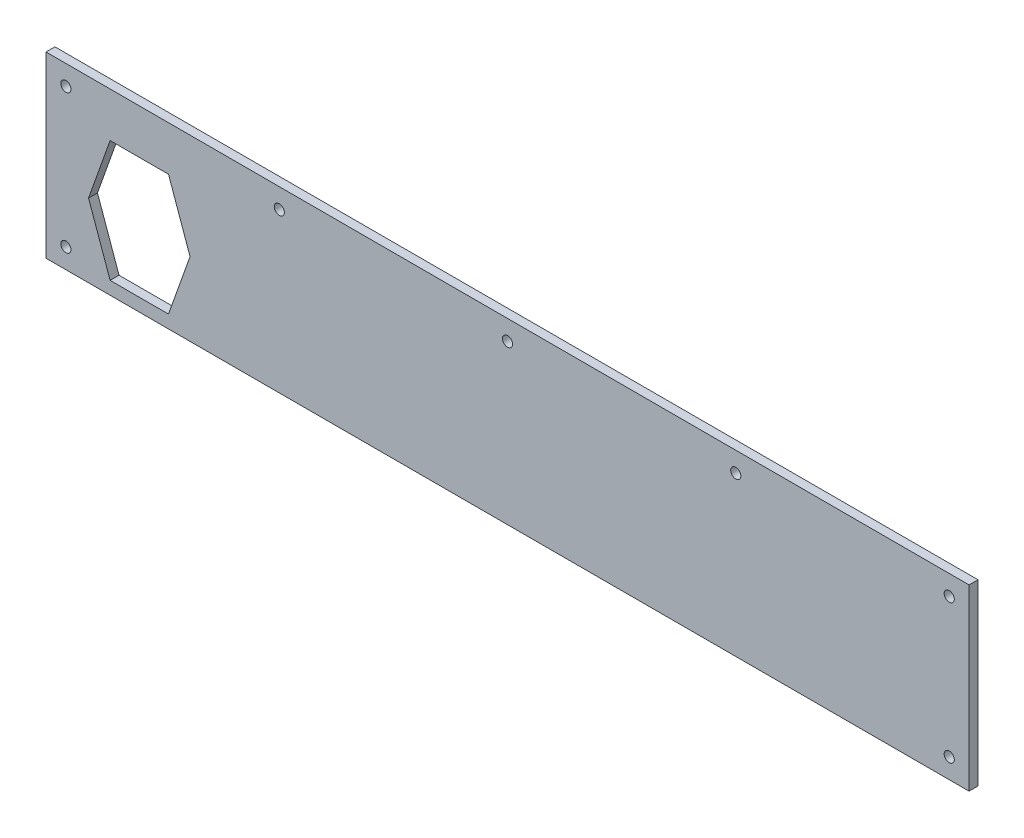
ISO-10303-21;
HEADER;
FILE_DESCRIPTION(('STEP AP214'),'2;1');
FILE_NAME('part.step','',(''),(''),'','','');
FILE_SCHEMA(('AUTOMOTIVE_DESIGN { 1 0 10303 214 1 1 1 1 }'));
ENDSEC;
DATA;
#1=APPLICATION_CONTEXT('core data for automotive mechanical design processes');
#2=APPLICATION_PROTOCOL_DEFINITION('international standard','automotive_design',2000,#1);
#3=PRODUCT_CONTEXT('',#1,'mechanical');
#4=PRODUCT('Part','Part','',(#3));
#5=PRODUCT_RELATED_PRODUCT_CATEGORY('part','',(#4));
#6=PRODUCT_DEFINITION_FORMATION('','',#4);
#7=PRODUCT_DEFINITION_CONTEXT('part definition',#1,'design');
#8=PRODUCT_DEFINITION('design','',#6,#7);
#9=PRODUCT_DEFINITION_SHAPE('','',#8);
#10=(LENGTH_UNIT() NAMED_UNIT(*) SI_UNIT(.MILLI.,.METRE.));
#11=(NAMED_UNIT(*) PLANE_ANGLE_UNIT() SI_UNIT($,.RADIAN.));
#12=(NAMED_UNIT(*) SI_UNIT($,.STERADIAN.) SOLID_ANGLE_UNIT());
#13=UNCERTAINTY_MEASURE_WITH_UNIT(LENGTH_MEASURE(1.E-05),#10,'distance_accuracy_value','');
#14=(GEOMETRIC_REPRESENTATION_CONTEXT(3) GLOBAL_UNCERTAINTY_ASSIGNED_CONTEXT((#13)) GLOBAL_UNIT_ASSIGNED_CONTEXT((#10,
#11,#12)) REPRESENTATION_CONTEXT('',''));
#15=CARTESIAN_POINT('',(0.,0.,0.));
#16=DIRECTION('',(0.,0.,1.));
#17=DIRECTION('',(1.,0.,0.));
#18=AXIS2_PLACEMENT_3D('',#15,#16,#17);
#19=CARTESIAN_POINT('',(0.,0.,2.2479));
#20=DIRECTION('',(0.,0.,-1.));
#21=DIRECTION('',(-1.,0.,0.));
#22=AXIS2_PLACEMENT_3D('',#19,#20,#21);
#23=PLANE('',#22);
#24=DIRECTION('',(-0.335324665526644,0.942102631717715,0.));
#25=VECTOR('',#24,1.);
#26=CARTESIAN_POINT('',(-159.938544521231,-7.99999999999997,2.2479));
#27=LINE('',#26,#25);
#28=CARTESIAN_POINT('',(-159.938544521231,-7.99999999999997,2.2479));
#29=VERTEX_POINT('',#28);
#30=CARTESIAN_POINT('',(-170.79447672462,22.5,2.2479));
#31=VERTEX_POINT('',#30);
#32=EDGE_CURVE('E130',#29,#31,#27,.T.);
#33=ORIENTED_EDGE('',*,*,#32,.F.);
#34=DIRECTION('',(0.335324665526644,0.942102631717715,0.));
#35=VECTOR('',#34,1.);
#36=CARTESIAN_POINT('',(-170.79447672462,-38.5,2.2479));
#37=LINE('',#36,#35);
#38=CARTESIAN_POINT('',(-170.79447672462,-38.5,2.2479));
#39=VERTEX_POINT('',#38);
#40=EDGE_CURVE('E48',#39,#29,#37,.T.);
#41=ORIENTED_EDGE('',*,*,#40,.F.);
#42=DIRECTION('',(1.,0.,0.));
#43=VECTOR('',#42,1.);
#44=CARTESIAN_POINT('',(-200.20552327538,-38.5,2.2479));
#45=LINE('',#44,#43);
#46=CARTESIAN_POINT('',(-200.20552327538,-38.5,2.2479));
#47=VERTEX_POINT('',#46);
#48=EDGE_CURVE('E122',#47,#39,#45,.T.);
#49=ORIENTED_EDGE('',*,*,#48,.F.);
#50=DIRECTION('',(0.335324665526644,-0.942102631717715,0.));
#51=VECTOR('',#50,1.);
#52=CARTESIAN_POINT('',(-211.06145547877,-7.99999999999997,2.2479));
#53=LINE('',#52,#51);
#54=CARTESIAN_POINT('',(-211.06145547877,-7.99999999999997,2.2479));
#55=VERTEX_POINT('',#54);
#56=EDGE_CURVE('E143',#55,#47,#53,.T.);
#57=ORIENTED_EDGE('',*,*,#56,.F.);
#58=DIRECTION('',(-0.335324665526644,-0.942102631717715,0.));
#59=VECTOR('',#58,1.);
#60=CARTESIAN_POINT('',(-200.20552327538,22.5,2.2479));
#61=LINE('',#60,#59);
#62=CARTESIAN_POINT('',(-200.20552327538,22.5,2.2479));
#63=VERTEX_POINT('',#62);
#64=EDGE_CURVE('E140',#63,#55,#61,.T.);
#65=ORIENTED_EDGE('',*,*,#64,.F.);
#66=DIRECTION('',(-1.,0.,0.));
#67=VECTOR('',#66,1.);
#68=CARTESIAN_POINT('',(-170.79447672462,22.5,2.2479));
#69=LINE('',#68,#67);
#70=EDGE_CURVE('E137',#31,#63,#69,.T.);
#71=ORIENTED_EDGE('',*,*,#70,.F.);
#72=EDGE_LOOP('',(#33,#41,#49,#57,#65,#71));
#73=FACE_BOUND('',#72,.T.);
#74=CARTESIAN_POINT('',(222.5,35.,2.2479));
#75=DIRECTION('',(0.,0.,1.));
#76=DIRECTION('',(-1.,0.,0.));
#77=AXIS2_PLACEMENT_3D('',#74,#75,#76);
#78=CIRCLE('',#77,2.54999999999999);
#79=CARTESIAN_POINT('',(219.95,35.,2.2479));
#80=VERTEX_POINT('',#79);
#81=EDGE_CURVE('E162',#80,#80,#78,.T.);
#82=ORIENTED_EDGE('',*,*,#81,.F.);
#83=EDGE_LOOP('',(#82));
#84=FACE_BOUND('',#83,.T.);
#85=CARTESIAN_POINT('',(-114.975,35.,2.2479));
#86=DIRECTION('',(0.,0.,1.));
#87=DIRECTION('',(1.,0.,0.));
#88=AXIS2_PLACEMENT_3D('',#85,#86,#87);
#89=CIRCLE('',#88,2.54999999999999);
#90=CARTESIAN_POINT('',(-112.425,35.,2.2479));
#91=VERTEX_POINT('',#90);
#92=EDGE_CURVE('E174',#91,#91,#89,.T.);
#93=ORIENTED_EDGE('',*,*,#92,.F.);
#94=EDGE_LOOP('',(#93));
#95=FACE_BOUND('',#94,.T.);
#96=CARTESIAN_POINT('',(-222.5,-35.,2.2479));
#97=DIRECTION('',(0.,0.,1.));
#98=DIRECTION('',(1.,0.,0.));
#99=AXIS2_PLACEMENT_3D('',#96,#97,#98);
#100=CIRCLE('',#99,2.54999999999999);
#101=CARTESIAN_POINT('',(-219.95,-35.,2.2479));
#102=VERTEX_POINT('',#101);
#103=EDGE_CURVE('E186',#102,#102,#100,.T.);
#104=ORIENTED_EDGE('',*,*,#103,.F.);
#105=EDGE_LOOP('',(#104));
#106=FACE_BOUND('',#105,.T.);
#107=DIRECTION('',(0.,1.,0.));
#108=VECTOR('',#107,1.);
#109=CARTESIAN_POINT('',(232.5,-45.,2.2479));
#110=LINE('',#109,#108);
#111=CARTESIAN_POINT('',(232.5,-45.,2.2479));
#112=VERTEX_POINT('',#111);
#113=CARTESIAN_POINT('',(232.5,45.,2.2479));
#114=VERTEX_POINT('',#113);
#115=EDGE_CURVE('E198',#112,#114,#110,.T.);
#116=ORIENTED_EDGE('',*,*,#115,.T.);
#117=DIRECTION('',(-1.,0.,0.));
#118=VECTOR('',#117,1.);
#119=CARTESIAN_POINT('',(-232.5,45.,2.2479));
#120=LINE('',#119,#118);
#121=CARTESIAN_POINT('',(-232.5,45.,2.2479));
#122=VERTEX_POINT('',#121);
#123=EDGE_CURVE('E201',#114,#122,#120,.T.);
#124=ORIENTED_EDGE('',*,*,#123,.T.);
#125=DIRECTION('',(0.,-1.,0.));
#126=VECTOR('',#125,1.);
#127=CARTESIAN_POINT('',(-232.5,-45.,2.2479));
#128=LINE('',#127,#126);
#129=CARTESIAN_POINT('',(-232.5,-45.,2.2479));
#130=VERTEX_POINT('',#129);
#131=EDGE_CURVE('E204',#122,#130,#128,.T.);
#132=ORIENTED_EDGE('',*,*,#131,.T.);
#133=DIRECTION('',(1.,0.,0.));
#134=VECTOR('',#133,1.);
#135=CARTESIAN_POINT('',(-232.5,-45.,2.2479));
#136=LINE('',#135,#134);
#137=EDGE_CURVE('E206',#130,#112,#136,.T.);
#138=ORIENTED_EDGE('',*,*,#137,.T.);
#139=EDGE_LOOP('',(#116,#124,#132,#138));
#140=FACE_BOUND('',#139,.T.);
#141=CARTESIAN_POINT('',(-222.5,35.,2.2479));
#142=DIRECTION('',(0.,0.,1.));
#143=DIRECTION('',(1.,0.,0.));
#144=AXIS2_PLACEMENT_3D('',#141,#142,#143);
#145=CIRCLE('',#144,2.54999999999999);
#146=CARTESIAN_POINT('',(-219.95,35.,2.2479));
#147=VERTEX_POINT('',#146);
#148=EDGE_CURVE('E192',#147,#147,#145,.T.);
#149=ORIENTED_EDGE('',*,*,#148,.F.);
#150=EDGE_LOOP('',(#149));
#151=FACE_BOUND('',#150,.T.);
#152=CARTESIAN_POINT('',(0.,35.,2.2479));
#153=DIRECTION('',(0.,0.,1.));
#154=DIRECTION('',(1.,0.,0.));
#155=AXIS2_PLACEMENT_3D('',#152,#153,#154);
#156=CIRCLE('',#155,2.55);
#157=CARTESIAN_POINT('',(2.55,35.,2.2479));
#158=VERTEX_POINT('',#157);
#159=EDGE_CURVE('E180',#158,#158,#156,.T.);
#160=ORIENTED_EDGE('',*,*,#159,.F.);
#161=EDGE_LOOP('',(#160));
#162=FACE_BOUND('',#161,.T.);
#163=CARTESIAN_POINT('',(222.5,-34.9999999999999,2.2479));
#164=DIRECTION('',(0.,0.,1.));
#165=DIRECTION('',(-1.,0.,0.));
#166=AXIS2_PLACEMENT_3D('',#163,#164,#165);
#167=CIRCLE('',#166,2.54999999999999);
#168=CARTESIAN_POINT('',(219.95,-34.9999999999999,2.2479));
#169=VERTEX_POINT('',#168);
#170=EDGE_CURVE('E168',#169,#169,#167,.T.);
#171=ORIENTED_EDGE('',*,*,#170,.F.);
#172=EDGE_LOOP('',(#171));
#173=FACE_BOUND('',#172,.T.);
#174=CARTESIAN_POINT('',(114.975,35.,2.2479));
#175=DIRECTION('',(0.,0.,1.));
#176=DIRECTION('',(-1.,0.,0.));
#177=AXIS2_PLACEMENT_3D('',#174,#175,#176);
#178=CIRCLE('',#177,2.54999999999999);
#179=CARTESIAN_POINT('',(112.425,35.,2.2479));
#180=VERTEX_POINT('',#179);
#181=EDGE_CURVE('E156',#180,#180,#178,.T.);
#182=ORIENTED_EDGE('',*,*,#181,.F.);
#183=EDGE_LOOP('',(#182));
#184=FACE_BOUND('',#183,.T.);
#185=ADVANCED_FACE('F33',(#73,#84,#95,#106,#140,#151,#162,#173,#184),#23,.F.);
#186=CARTESIAN_POINT('',(0.,0.,-2.2479));
#187=DIRECTION('',(0.,0.,-1.));
#188=DIRECTION('',(-1.,0.,0.));
#189=AXIS2_PLACEMENT_3D('',#186,#187,#188);
#190=PLANE('',#189);
#191=DIRECTION('',(0.335324665526644,0.942102631717715,0.));
#192=VECTOR('',#191,1.);
#193=CARTESIAN_POINT('',(-170.79447672462,-38.5,-2.2479));
#194=LINE('',#193,#192);
#195=CARTESIAN_POINT('',(-170.79447672462,-38.5,-2.2479));
#196=VERTEX_POINT('',#195);
#197=CARTESIAN_POINT('',(-159.938544521231,-7.99999999999997,-2.2479));
#198=VERTEX_POINT('',#197);
#199=EDGE_CURVE('E120',#196,#198,#194,.T.);
#200=ORIENTED_EDGE('',*,*,#199,.T.);
#201=DIRECTION('',(-0.335324665526644,0.942102631717715,0.));
#202=VECTOR('',#201,1.);
#203=CARTESIAN_POINT('',(-159.938544521231,-7.99999999999997,-2.2479));
#204=LINE('',#203,#202);
#205=CARTESIAN_POINT('',(-170.79447672462,22.5,-2.2479));
#206=VERTEX_POINT('',#205);
#207=EDGE_CURVE('E109',#198,#206,#204,.T.);
#208=ORIENTED_EDGE('',*,*,#207,.T.);
#209=DIRECTION('',(-1.,0.,0.));
#210=VECTOR('',#209,1.);
#211=CARTESIAN_POINT('',(-170.79447672462,22.5,-2.2479));
#212=LINE('',#211,#210);
#213=CARTESIAN_POINT('',(-200.20552327538,22.5,-2.2479));
#214=VERTEX_POINT('',#213);
#215=EDGE_CURVE('E404',#206,#214,#212,.T.);
#216=ORIENTED_EDGE('',*,*,#215,.T.);
#217=DIRECTION('',(-0.335324665526644,-0.942102631717715,0.));
#218=VECTOR('',#217,1.);
#219=CARTESIAN_POINT('',(-200.20552327538,22.5,-2.2479));
#220=LINE('',#219,#218);
#221=CARTESIAN_POINT('',(-211.06145547877,-7.99999999999996,-2.2479));
#222=VERTEX_POINT('',#221);
#223=EDGE_CURVE('E409',#214,#222,#220,.T.);
#224=ORIENTED_EDGE('',*,*,#223,.T.);
#225=DIRECTION('',(0.335324665526644,-0.942102631717715,0.));
#226=VECTOR('',#225,1.);
#227=CARTESIAN_POINT('',(-211.06145547877,-7.99999999999997,-2.2479));
#228=LINE('',#227,#226);
#229=CARTESIAN_POINT('',(-200.20552327538,-38.5,-2.2479));
#230=VERTEX_POINT('',#229);
#231=EDGE_CURVE('E132',#222,#230,#228,.T.);
#232=ORIENTED_EDGE('',*,*,#231,.T.);
#233=DIRECTION('',(1.,0.,0.));
#234=VECTOR('',#233,1.);
#235=CARTESIAN_POINT('',(-200.20552327538,-38.5,-2.2479));
#236=LINE('',#235,#234);
#237=EDGE_CURVE('E128',#230,#196,#236,.T.);
#238=ORIENTED_EDGE('',*,*,#237,.T.);
#239=EDGE_LOOP('',(#200,#208,#216,#224,#232,#238));
#240=FACE_BOUND('',#239,.T.);
#241=CARTESIAN_POINT('',(222.5,35.,-2.2479));
#242=DIRECTION('',(0.,0.,1.));
#243=DIRECTION('',(-1.,0.,0.));
#244=AXIS2_PLACEMENT_3D('',#241,#242,#243);
#245=CIRCLE('',#244,2.54999999999999);
#246=CARTESIAN_POINT('',(219.95,35.,-2.2479));
#247=VERTEX_POINT('',#246);
#248=EDGE_CURVE('E159',#247,#247,#245,.T.);
#249=ORIENTED_EDGE('',*,*,#248,.T.);
#250=EDGE_LOOP('',(#249));
#251=FACE_BOUND('',#250,.T.);
#252=CARTESIAN_POINT('',(-114.975,35.,-2.2479));
#253=DIRECTION('',(0.,0.,1.));
#254=DIRECTION('',(1.,0.,0.));
#255=AXIS2_PLACEMENT_3D('',#252,#253,#254);
#256=CIRCLE('',#255,2.54999999999999);
#257=CARTESIAN_POINT('',(-112.425,35.,-2.2479));
#258=VERTEX_POINT('',#257);
#259=EDGE_CURVE('E171',#258,#258,#256,.T.);
#260=ORIENTED_EDGE('',*,*,#259,.T.);
#261=EDGE_LOOP('',(#260));
#262=FACE_BOUND('',#261,.T.);
#263=CARTESIAN_POINT('',(-222.5,-35.,-2.2479));
#264=DIRECTION('',(0.,0.,1.));
#265=DIRECTION('',(1.,0.,0.));
#266=AXIS2_PLACEMENT_3D('',#263,#264,#265);
#267=CIRCLE('',#266,2.54999999999999);
#268=CARTESIAN_POINT('',(-219.95,-35.,-2.2479));
#269=VERTEX_POINT('',#268);
#270=EDGE_CURVE('E183',#269,#269,#267,.T.);
#271=ORIENTED_EDGE('',*,*,#270,.T.);
#272=EDGE_LOOP('',(#271));
#273=FACE_BOUND('',#272,.T.);
#274=DIRECTION('',(0.,1.,0.));
#275=VECTOR('',#274,1.);
#276=CARTESIAN_POINT('',(232.5,-45.,-2.2479));
#277=LINE('',#276,#275);
#278=CARTESIAN_POINT('',(232.5,-45.,-2.2479));
#279=VERTEX_POINT('',#278);
#280=CARTESIAN_POINT('',(232.5,45.,-2.2479));
#281=VERTEX_POINT('',#280);
#282=EDGE_CURVE('E195',#279,#281,#277,.T.);
#283=ORIENTED_EDGE('',*,*,#282,.F.);
#284=DIRECTION('',(1.,0.,0.));
#285=VECTOR('',#284,1.);
#286=CARTESIAN_POINT('',(-232.5,-45.,-2.2479));
#287=LINE('',#286,#285);
#288=CARTESIAN_POINT('',(-232.5,-45.,-2.2479));
#289=VERTEX_POINT('',#288);
#290=EDGE_CURVE('E202',#289,#279,#287,.T.);
#291=ORIENTED_EDGE('',*,*,#290,.F.);
#292=DIRECTION('',(0.,-1.,0.));
#293=VECTOR('',#292,1.);
#294=CARTESIAN_POINT('',(-232.5,-45.,-2.2479));
#295=LINE('',#294,#293);
#296=CARTESIAN_POINT('',(-232.5,45.,-2.2479));
#297=VERTEX_POINT('',#296);
#298=EDGE_CURVE('E213',#297,#289,#295,.T.);
#299=ORIENTED_EDGE('',*,*,#298,.F.);
#300=DIRECTION('',(-1.,0.,0.));
#301=VECTOR('',#300,1.);
#302=CARTESIAN_POINT('',(-232.5,45.,-2.2479));
#303=LINE('',#302,#301);
#304=EDGE_CURVE('E211',#281,#297,#303,.T.);
#305=ORIENTED_EDGE('',*,*,#304,.F.);
#306=EDGE_LOOP('',(#283,#291,#299,#305));
#307=FACE_BOUND('',#306,.T.);
#308=CARTESIAN_POINT('',(-222.5,35.,-2.2479));
#309=DIRECTION('',(0.,0.,1.));
#310=DIRECTION('',(1.,0.,0.));
#311=AXIS2_PLACEMENT_3D('',#308,#309,#310);
#312=CIRCLE('',#311,2.54999999999999);
#313=CARTESIAN_POINT('',(-219.95,35.,-2.2479));
#314=VERTEX_POINT('',#313);
#315=EDGE_CURVE('E189',#314,#314,#312,.T.);
#316=ORIENTED_EDGE('',*,*,#315,.T.);
#317=EDGE_LOOP('',(#316));
#318=FACE_BOUND('',#317,.T.);
#319=CARTESIAN_POINT('',(0.,35.,-2.2479));
#320=DIRECTION('',(0.,0.,1.));
#321=DIRECTION('',(1.,0.,0.));
#322=AXIS2_PLACEMENT_3D('',#319,#320,#321);
#323=CIRCLE('',#322,2.55);
#324=CARTESIAN_POINT('',(2.55,35.,-2.2479));
#325=VERTEX_POINT('',#324);
#326=EDGE_CURVE('E177',#325,#325,#323,.T.);
#327=ORIENTED_EDGE('',*,*,#326,.T.);
#328=EDGE_LOOP('',(#327));
#329=FACE_BOUND('',#328,.T.);
#330=CARTESIAN_POINT('',(222.5,-34.9999999999999,-2.2479));
#331=DIRECTION('',(0.,0.,1.));
#332=DIRECTION('',(-1.,0.,0.));
#333=AXIS2_PLACEMENT_3D('',#330,#331,#332);
#334=CIRCLE('',#333,2.54999999999999);
#335=CARTESIAN_POINT('',(219.95,-34.9999999999999,-2.2479));
#336=VERTEX_POINT('',#335);
#337=EDGE_CURVE('E165',#336,#336,#334,.T.);
#338=ORIENTED_EDGE('',*,*,#337,.T.);
#339=EDGE_LOOP('',(#338));
#340=FACE_BOUND('',#339,.T.);
#341=CARTESIAN_POINT('',(114.975,35.,-2.2479));
#342=DIRECTION('',(0.,0.,1.));
#343=DIRECTION('',(-1.,0.,0.));
#344=AXIS2_PLACEMENT_3D('',#341,#342,#343);
#345=CIRCLE('',#344,2.54999999999999);
#346=CARTESIAN_POINT('',(112.425,35.,-2.2479));
#347=VERTEX_POINT('',#346);
#348=EDGE_CURVE('E116',#347,#347,#345,.T.);
#349=ORIENTED_EDGE('',*,*,#348,.T.);
#350=EDGE_LOOP('',(#349));
#351=FACE_BOUND('',#350,.T.);
#352=ADVANCED_FACE('F125',(#240,#251,#262,#273,#307,#318,#329,#340,#351),#190,.T.);
#353=CARTESIAN_POINT('',(232.5,-45.,2.2479));
#354=DIRECTION('',(-1.,0.,0.));
#355=DIRECTION('',(0.,0.,1.));
#356=AXIS2_PLACEMENT_3D('',#353,#354,#355);
#357=PLANE('',#356);
#358=ORIENTED_EDGE('',*,*,#282,.T.);
#359=DIRECTION('',(0.,0.,-1.));
#360=VECTOR('',#359,1.);
#361=CARTESIAN_POINT('',(232.5,45.,2.2479));
#362=LINE('',#361,#360);
#363=EDGE_CURVE('E11',#114,#281,#362,.T.);
#364=ORIENTED_EDGE('',*,*,#363,.F.);
#365=ORIENTED_EDGE('',*,*,#115,.F.);
#366=DIRECTION('',(0.,0.,-1.));
#367=VECTOR('',#366,1.);
#368=CARTESIAN_POINT('',(232.5,-45.,2.2479));
#369=LINE('',#368,#367);
#370=EDGE_CURVE('E208',#112,#279,#369,.T.);
#371=ORIENTED_EDGE('',*,*,#370,.T.);
#372=EDGE_LOOP('',(#358,#364,#365,#371));
#373=FACE_BOUND('',#372,.T.);
#374=ADVANCED_FACE('F35',(#373),#357,.F.);
#375=CARTESIAN_POINT('',(-232.5,45.,2.2479));
#376=DIRECTION('',(0.,-1.,0.));
#377=DIRECTION('',(0.,0.,-1.));
#378=AXIS2_PLACEMENT_3D('',#375,#376,#377);
#379=PLANE('',#378);
#380=ORIENTED_EDGE('',*,*,#304,.T.);
#381=DIRECTION('',(0.,0.,-1.));
#382=VECTOR('',#381,1.);
#383=CARTESIAN_POINT('',(-232.5,45.,2.2479));
#384=LINE('',#383,#382);
#385=EDGE_CURVE('E41',#122,#297,#384,.T.);
#386=ORIENTED_EDGE('',*,*,#385,.F.);
#387=ORIENTED_EDGE('',*,*,#123,.F.);
#388=ORIENTED_EDGE('',*,*,#363,.T.);
#389=EDGE_LOOP('',(#380,#386,#387,#388));
#390=FACE_BOUND('',#389,.T.);
#391=ADVANCED_FACE('F241',(#390),#379,.F.);
#392=CARTESIAN_POINT('',(-232.5,-45.,2.2479));
#393=DIRECTION('',(1.,0.,0.));
#394=DIRECTION('',(0.,0.,-1.));
#395=AXIS2_PLACEMENT_3D('',#392,#393,#394);
#396=PLANE('',#395);
#397=ORIENTED_EDGE('',*,*,#298,.T.);
#398=DIRECTION('',(0.,0.,-1.));
#399=VECTOR('',#398,1.);
#400=CARTESIAN_POINT('',(-232.5,-45.,2.2479));
#401=LINE('',#400,#399);
#402=EDGE_CURVE('E218',#130,#289,#401,.T.);
#403=ORIENTED_EDGE('',*,*,#402,.F.);
#404=ORIENTED_EDGE('',*,*,#131,.F.);
#405=ORIENTED_EDGE('',*,*,#385,.T.);
#406=EDGE_LOOP('',(#397,#403,#404,#405));
#407=FACE_BOUND('',#406,.T.);
#408=ADVANCED_FACE('F225',(#407),#396,.F.);
#409=CARTESIAN_POINT('',(-232.5,-45.,2.2479));
#410=DIRECTION('',(0.,1.,0.));
#411=DIRECTION('',(0.,0.,1.));
#412=AXIS2_PLACEMENT_3D('',#409,#410,#411);
#413=PLANE('',#412);
#414=ORIENTED_EDGE('',*,*,#290,.T.);
#415=ORIENTED_EDGE('',*,*,#370,.F.);
#416=ORIENTED_EDGE('',*,*,#137,.F.);
#417=ORIENTED_EDGE('',*,*,#402,.T.);
#418=EDGE_LOOP('',(#414,#415,#416,#417));
#419=FACE_BOUND('',#418,.T.);
#420=ADVANCED_FACE('F234',(#419),#413,.F.);
#421=CARTESIAN_POINT('',(-222.5,35.,2.2479));
#422=DIRECTION('',(0.,0.,-1.));
#423=DIRECTION('',(-1.,0.,0.));
#424=AXIS2_PLACEMENT_3D('',#421,#422,#423);
#425=CYLINDRICAL_SURFACE('',#424,2.54999999999999);
#426=ORIENTED_EDGE('',*,*,#148,.T.);
#427=EDGE_LOOP('',(#426));
#428=FACE_BOUND('',#427,.T.);
#429=ORIENTED_EDGE('',*,*,#315,.F.);
#430=EDGE_LOOP('',(#429));
#431=FACE_BOUND('',#430,.T.);
#432=ADVANCED_FACE('F257',(#428,#431),#425,.F.);
#433=CARTESIAN_POINT('',(-222.5,-35.,2.2479));
#434=DIRECTION('',(0.,0.,-1.));
#435=DIRECTION('',(-1.,0.,0.));
#436=AXIS2_PLACEMENT_3D('',#433,#434,#435);
#437=CYLINDRICAL_SURFACE('',#436,2.54999999999999);
#438=ORIENTED_EDGE('',*,*,#103,.T.);
#439=EDGE_LOOP('',(#438));
#440=FACE_BOUND('',#439,.T.);
#441=ORIENTED_EDGE('',*,*,#270,.F.);
#442=EDGE_LOOP('',(#441));
#443=FACE_BOUND('',#442,.T.);
#444=ADVANCED_FACE('F264',(#440,#443),#437,.F.);
#445=CARTESIAN_POINT('',(0.,35.,2.2479));
#446=DIRECTION('',(0.,0.,-1.));
#447=DIRECTION('',(-1.,0.,0.));
#448=AXIS2_PLACEMENT_3D('',#445,#446,#447);
#449=CYLINDRICAL_SURFACE('',#448,2.55);
#450=ORIENTED_EDGE('',*,*,#159,.T.);
#451=EDGE_LOOP('',(#450));
#452=FACE_BOUND('',#451,.T.);
#453=ORIENTED_EDGE('',*,*,#326,.F.);
#454=EDGE_LOOP('',(#453));
#455=FACE_BOUND('',#454,.T.);
#456=ADVANCED_FACE('F269',(#452,#455),#449,.F.);
#457=CARTESIAN_POINT('',(-114.975,35.,2.2479));
#458=DIRECTION('',(0.,0.,-1.));
#459=DIRECTION('',(-1.,0.,0.));
#460=AXIS2_PLACEMENT_3D('',#457,#458,#459);
#461=CYLINDRICAL_SURFACE('',#460,2.54999999999999);
#462=ORIENTED_EDGE('',*,*,#92,.T.);
#463=EDGE_LOOP('',(#462));
#464=FACE_BOUND('',#463,.T.);
#465=ORIENTED_EDGE('',*,*,#259,.F.);
#466=EDGE_LOOP('',(#465));
#467=FACE_BOUND('',#466,.T.);
#468=ADVANCED_FACE('F299',(#464,#467),#461,.F.);
#469=CARTESIAN_POINT('',(222.5,-34.9999999999999,2.2479));
#470=DIRECTION('',(0.,0.,-1.));
#471=DIRECTION('',(-1.,0.,0.));
#472=AXIS2_PLACEMENT_3D('',#469,#470,#471);
#473=CYLINDRICAL_SURFACE('',#472,2.54999999999999);
#474=ORIENTED_EDGE('',*,*,#170,.T.);
#475=EDGE_LOOP('',(#474));
#476=FACE_BOUND('',#475,.T.);
#477=ORIENTED_EDGE('',*,*,#337,.F.);
#478=EDGE_LOOP('',(#477));
#479=FACE_BOUND('',#478,.T.);
#480=ADVANCED_FACE('F292',(#476,#479),#473,.F.);
#481=CARTESIAN_POINT('',(222.5,35.,2.2479));
#482=DIRECTION('',(0.,0.,-1.));
#483=DIRECTION('',(-1.,0.,0.));
#484=AXIS2_PLACEMENT_3D('',#481,#482,#483);
#485=CYLINDRICAL_SURFACE('',#484,2.54999999999999);
#486=ORIENTED_EDGE('',*,*,#81,.T.);
#487=EDGE_LOOP('',(#486));
#488=FACE_BOUND('',#487,.T.);
#489=ORIENTED_EDGE('',*,*,#248,.F.);
#490=EDGE_LOOP('',(#489));
#491=FACE_BOUND('',#490,.T.);
#492=ADVANCED_FACE('F283',(#488,#491),#485,.F.);
#493=CARTESIAN_POINT('',(114.975,35.,2.2479));
#494=DIRECTION('',(0.,0.,-1.));
#495=DIRECTION('',(-1.,0.,0.));
#496=AXIS2_PLACEMENT_3D('',#493,#494,#495);
#497=CYLINDRICAL_SURFACE('',#496,2.54999999999999);
#498=ORIENTED_EDGE('',*,*,#181,.T.);
#499=EDGE_LOOP('',(#498));
#500=FACE_BOUND('',#499,.T.);
#501=ORIENTED_EDGE('',*,*,#348,.F.);
#502=EDGE_LOOP('',(#501));
#503=FACE_BOUND('',#502,.T.);
#504=ADVANCED_FACE('F281',(#500,#503),#497,.F.);
#505=CARTESIAN_POINT('',(-170.79447672462,-38.5,-2.2489));
#506=DIRECTION('',(0.942102631717715,-0.335324665526644,0.));
#507=DIRECTION('',(0.335324665526644,0.942102631717715,0.));
#508=AXIS2_PLACEMENT_3D('',#505,#506,#507);
#509=PLANE('',#508);
#510=DIRECTION('',(0.,0.,1.));
#511=VECTOR('',#510,1.);
#512=CARTESIAN_POINT('',(-170.79447672462,-38.5,-2.2489));
#513=LINE('',#512,#511);
#514=EDGE_CURVE('E117',#196,#39,#513,.T.);
#515=ORIENTED_EDGE('',*,*,#514,.T.);
#516=ORIENTED_EDGE('',*,*,#40,.T.);
#517=DIRECTION('',(0.,0.,1.));
#518=VECTOR('',#517,1.);
#519=CARTESIAN_POINT('',(-159.938544521231,-7.99999999999997,-2.2489));
#520=LINE('',#519,#518);
#521=EDGE_CURVE('E111',#198,#29,#520,.T.);
#522=ORIENTED_EDGE('',*,*,#521,.F.);
#523=ORIENTED_EDGE('',*,*,#199,.F.);
#524=EDGE_LOOP('',(#515,#516,#522,#523));
#525=FACE_BOUND('',#524,.T.);
#526=ADVANCED_FACE('F119',(#525),#509,.F.);
#527=CARTESIAN_POINT('',(-200.20552327538,-38.5,-2.2489));
#528=DIRECTION('',(0.,-1.,0.));
#529=DIRECTION('',(0.,0.,-1.));
#530=AXIS2_PLACEMENT_3D('',#527,#528,#529);
#531=PLANE('',#530);
#532=DIRECTION('',(0.,0.,1.));
#533=VECTOR('',#532,1.);
#534=CARTESIAN_POINT('',(-200.20552327538,-38.5,-2.2489));
#535=LINE('',#534,#533);
#536=EDGE_CURVE('E149',#230,#47,#535,.T.);
#537=ORIENTED_EDGE('',*,*,#536,.T.);
#538=ORIENTED_EDGE('',*,*,#48,.T.);
#539=ORIENTED_EDGE('',*,*,#514,.F.);
#540=ORIENTED_EDGE('',*,*,#237,.F.);
#541=EDGE_LOOP('',(#537,#538,#539,#540));
#542=FACE_BOUND('',#541,.T.);
#543=ADVANCED_FACE('F290',(#542),#531,.F.);
#544=CARTESIAN_POINT('',(-211.06145547877,-7.99999999999997,-2.2489));
#545=DIRECTION('',(-0.942102631717715,-0.335324665526644,0.));
#546=DIRECTION('',(0.335324665526644,-0.942102631717715,0.));
#547=AXIS2_PLACEMENT_3D('',#544,#545,#546);
#548=PLANE('',#547);
#549=DIRECTION('',(0.,0.,1.));
#550=VECTOR('',#549,1.);
#551=CARTESIAN_POINT('',(-211.06145547877,-7.99999999999997,-2.2489));
#552=LINE('',#551,#550);
#553=EDGE_CURVE('E151',#222,#55,#552,.T.);
#554=ORIENTED_EDGE('',*,*,#553,.T.);
#555=ORIENTED_EDGE('',*,*,#56,.T.);
#556=ORIENTED_EDGE('',*,*,#536,.F.);
#557=ORIENTED_EDGE('',*,*,#231,.F.);
#558=EDGE_LOOP('',(#554,#555,#556,#557));
#559=FACE_BOUND('',#558,.T.);
#560=ADVANCED_FACE('F360',(#559),#548,.F.);
#561=CARTESIAN_POINT('',(-200.20552327538,22.5,-2.2489));
#562=DIRECTION('',(-0.942102631717715,0.335324665526644,0.));
#563=DIRECTION('',(-0.335324665526644,-0.942102631717715,0.));
#564=AXIS2_PLACEMENT_3D('',#561,#562,#563);
#565=PLANE('',#564);
#566=DIRECTION('',(0.,0.,1.));
#567=VECTOR('',#566,1.);
#568=CARTESIAN_POINT('',(-200.20552327538,22.5,-2.2489));
#569=LINE('',#568,#567);
#570=EDGE_CURVE('E153',#214,#63,#569,.T.);
#571=ORIENTED_EDGE('',*,*,#570,.T.);
#572=ORIENTED_EDGE('',*,*,#64,.T.);
#573=ORIENTED_EDGE('',*,*,#553,.F.);
#574=ORIENTED_EDGE('',*,*,#223,.F.);
#575=EDGE_LOOP('',(#571,#572,#573,#574));
#576=FACE_BOUND('',#575,.T.);
#577=ADVANCED_FACE('F370',(#576),#565,.F.);
#578=CARTESIAN_POINT('',(-170.79447672462,22.5,-2.2489));
#579=DIRECTION('',(0.,1.,0.));
#580=DIRECTION('',(0.,0.,1.));
#581=AXIS2_PLACEMENT_3D('',#578,#579,#580);
#582=PLANE('',#581);
#583=DIRECTION('',(0.,0.,1.));
#584=VECTOR('',#583,1.);
#585=CARTESIAN_POINT('',(-170.79447672462,22.5,-2.2489));
#586=LINE('',#585,#584);
#587=EDGE_CURVE('E56',#206,#31,#586,.T.);
#588=ORIENTED_EDGE('',*,*,#587,.T.);
#589=ORIENTED_EDGE('',*,*,#70,.T.);
#590=ORIENTED_EDGE('',*,*,#570,.F.);
#591=ORIENTED_EDGE('',*,*,#215,.F.);
#592=EDGE_LOOP('',(#588,#589,#590,#591));
#593=FACE_BOUND('',#592,.T.);
#594=ADVANCED_FACE('F380',(#593),#582,.F.);
#595=CARTESIAN_POINT('',(-159.938544521231,-7.99999999999997,-2.2489));
#596=DIRECTION('',(0.942102631717715,0.335324665526644,0.));
#597=DIRECTION('',(-0.335324665526644,0.942102631717715,0.));
#598=AXIS2_PLACEMENT_3D('',#595,#596,#597);
#599=PLANE('',#598);
#600=ORIENTED_EDGE('',*,*,#521,.T.);
#601=ORIENTED_EDGE('',*,*,#32,.T.);
#602=ORIENTED_EDGE('',*,*,#587,.F.);
#603=ORIENTED_EDGE('',*,*,#207,.F.);
#604=EDGE_LOOP('',(#600,#601,#602,#603));
#605=FACE_BOUND('',#604,.T.);
#606=ADVANCED_FACE('F110',(#605),#599,.F.);
#607=CLOSED_SHELL('',(#185,#352,#374,#391,#408,#420,#432,#444,#456,#468,#480,#492,#504,#526,
#543,#560,#577,#594,#606));
#608=MANIFOLD_SOLID_BREP('B2',#607);
#609=ADVANCED_BREP_SHAPE_REPRESENTATION('',(#18,#608),#14);
#610=SHAPE_DEFINITION_REPRESENTATION(#9,#609);
ENDSEC;
END-ISO-10303-21;
